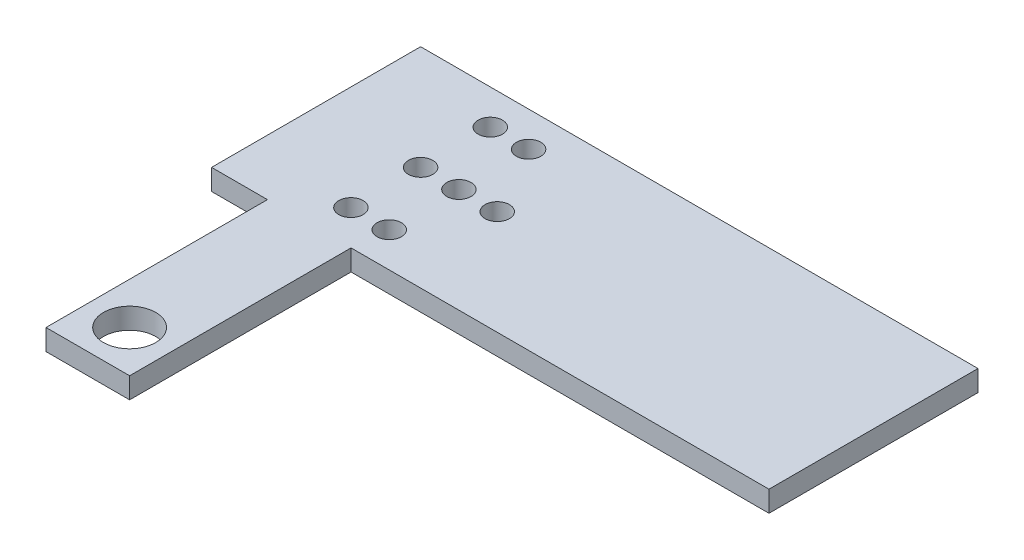
ISO-10303-21;
HEADER;
FILE_DESCRIPTION(('STEP AP214'),'2;1');
FILE_NAME('part.step','',(''),(''),'','','');
FILE_SCHEMA(('AUTOMOTIVE_DESIGN { 1 0 10303 214 1 1 1 1 }'));
ENDSEC;
DATA;
#1=APPLICATION_CONTEXT('core data for automotive mechanical design processes');
#2=APPLICATION_PROTOCOL_DEFINITION('international standard','automotive_design',2000,#1);
#3=PRODUCT_CONTEXT('',#1,'mechanical');
#4=PRODUCT('Part','Part','',(#3));
#5=PRODUCT_RELATED_PRODUCT_CATEGORY('part','',(#4));
#6=PRODUCT_DEFINITION_FORMATION('','',#4);
#7=PRODUCT_DEFINITION_CONTEXT('part definition',#1,'design');
#8=PRODUCT_DEFINITION('design','',#6,#7);
#9=PRODUCT_DEFINITION_SHAPE('','',#8);
#10=(LENGTH_UNIT() NAMED_UNIT(*) SI_UNIT(.MILLI.,.METRE.));
#11=(NAMED_UNIT(*) PLANE_ANGLE_UNIT() SI_UNIT($,.RADIAN.));
#12=(NAMED_UNIT(*) SI_UNIT($,.STERADIAN.) SOLID_ANGLE_UNIT());
#13=UNCERTAINTY_MEASURE_WITH_UNIT(LENGTH_MEASURE(1.E-05),#10,'distance_accuracy_value','');
#14=(GEOMETRIC_REPRESENTATION_CONTEXT(3) GLOBAL_UNCERTAINTY_ASSIGNED_CONTEXT((#13)) GLOBAL_UNIT_ASSIGNED_CONTEXT((#10,
#11,#12)) REPRESENTATION_CONTEXT('',''));
#15=CARTESIAN_POINT('',(0.,0.,0.));
#16=DIRECTION('',(0.,0.,1.));
#17=DIRECTION('',(1.,0.,0.));
#18=AXIS2_PLACEMENT_3D('',#15,#16,#17);
#19=CARTESIAN_POINT('',(-40.,3.,15.));
#20=DIRECTION('',(0.,0.,-1.));
#21=DIRECTION('',(-1.,0.,0.));
#22=AXIS2_PLACEMENT_3D('',#19,#20,#21);
#23=PLANE('',#22);
#24=DIRECTION('',(0.,-1.,0.));
#25=VECTOR('',#24,1.);
#26=CARTESIAN_POINT('',(-31.9821782216686,3.,15.));
#27=LINE('',#26,#25);
#28=CARTESIAN_POINT('',(-31.9821782216686,3.,15.));
#29=VERTEX_POINT('',#28);
#30=CARTESIAN_POINT('',(-31.9821782216686,0.,15.));
#31=VERTEX_POINT('',#30);
#32=EDGE_CURVE('E119',#29,#31,#27,.T.);
#33=ORIENTED_EDGE('',*,*,#32,.F.);
#34=DIRECTION('',(1.,0.,0.));
#35=VECTOR('',#34,1.);
#36=CARTESIAN_POINT('',(-40.,3.,15.));
#37=LINE('',#36,#35);
#38=CARTESIAN_POINT('',(-40.,3.,15.));
#39=VERTEX_POINT('',#38);
#40=EDGE_CURVE('E124',#39,#29,#37,.T.);
#41=ORIENTED_EDGE('',*,*,#40,.F.);
#42=DIRECTION('',(0.,-1.,0.));
#43=VECTOR('',#42,1.);
#44=CARTESIAN_POINT('',(-40.,3.,15.));
#45=LINE('',#44,#43);
#46=CARTESIAN_POINT('',(-40.,0.,15.));
#47=VERTEX_POINT('',#46);
#48=EDGE_CURVE('E144',#39,#47,#45,.T.);
#49=ORIENTED_EDGE('',*,*,#48,.T.);
#50=DIRECTION('',(1.,0.,0.));
#51=VECTOR('',#50,1.);
#52=CARTESIAN_POINT('',(-40.,0.,15.));
#53=LINE('',#52,#51);
#54=EDGE_CURVE('E139',#47,#31,#53,.T.);
#55=ORIENTED_EDGE('',*,*,#54,.T.);
#56=EDGE_LOOP('',(#33,#41,#49,#55));
#57=FACE_BOUND('',#56,.T.);
#58=ADVANCED_FACE('F33',(#57),#23,.F.);
#59=CARTESIAN_POINT('',(-14.,0.,0.));
#60=DIRECTION('',(0.,1.,0.));
#61=DIRECTION('',(0.,0.,1.));
#62=AXIS2_PLACEMENT_3D('',#59,#60,#61);
#63=CYLINDRICAL_SURFACE('',#62,1.75);
#64=CARTESIAN_POINT('',(-14.,0.,0.));
#65=DIRECTION('',(0.,1.,0.));
#66=DIRECTION('',(0.,0.,1.));
#67=AXIS2_PLACEMENT_3D('',#64,#65,#66);
#68=CIRCLE('',#67,1.75);
#69=CARTESIAN_POINT('',(-14.,0.,1.75));
#70=VERTEX_POINT('',#69);
#71=EDGE_CURVE('E41',#70,#70,#68,.T.);
#72=ORIENTED_EDGE('',*,*,#71,.F.);
#73=EDGE_LOOP('',(#72));
#74=FACE_BOUND('',#73,.T.);
#75=CARTESIAN_POINT('',(-14.,3.,0.));
#76=DIRECTION('',(0.,1.,0.));
#77=DIRECTION('',(0.,0.,1.));
#78=AXIS2_PLACEMENT_3D('',#75,#76,#77);
#79=CIRCLE('',#78,1.75);
#80=CARTESIAN_POINT('',(-14.,3.,1.75));
#81=VERTEX_POINT('',#80);
#82=EDGE_CURVE('E11',#81,#81,#79,.T.);
#83=ORIENTED_EDGE('',*,*,#82,.T.);
#84=EDGE_LOOP('',(#83));
#85=FACE_BOUND('',#84,.T.);
#86=ADVANCED_FACE('F35',(#74,#85),#63,.F.);
#87=CARTESIAN_POINT('',(40.,3.,15.));
#88=DIRECTION('',(-1.,0.,0.));
#89=DIRECTION('',(0.,0.,1.));
#90=AXIS2_PLACEMENT_3D('',#87,#88,#89);
#91=PLANE('',#90);
#92=DIRECTION('',(0.,0.,-1.));
#93=VECTOR('',#92,1.);
#94=CARTESIAN_POINT('',(40.,0.,15.));
#95=LINE('',#94,#93);
#96=CARTESIAN_POINT('',(40.,0.,15.));
#97=VERTEX_POINT('',#96);
#98=CARTESIAN_POINT('',(40.,0.,-15.));
#99=VERTEX_POINT('',#98);
#100=EDGE_CURVE('E131',#97,#99,#95,.T.);
#101=ORIENTED_EDGE('',*,*,#100,.T.);
#102=DIRECTION('',(0.,-1.,0.));
#103=VECTOR('',#102,1.);
#104=CARTESIAN_POINT('',(40.,3.,-15.));
#105=LINE('',#104,#103);
#106=CARTESIAN_POINT('',(40.,3.,-15.));
#107=VERTEX_POINT('',#106);
#108=EDGE_CURVE('E150',#107,#99,#105,.T.);
#109=ORIENTED_EDGE('',*,*,#108,.F.);
#110=DIRECTION('',(0.,0.,-1.));
#111=VECTOR('',#110,1.);
#112=CARTESIAN_POINT('',(40.,3.,15.));
#113=LINE('',#112,#111);
#114=CARTESIAN_POINT('',(40.,3.,15.));
#115=VERTEX_POINT('',#114);
#116=EDGE_CURVE('E142',#115,#107,#113,.T.);
#117=ORIENTED_EDGE('',*,*,#116,.F.);
#118=DIRECTION('',(0.,-1.,0.));
#119=VECTOR('',#118,1.);
#120=CARTESIAN_POINT('',(40.,3.,15.));
#121=LINE('',#120,#119);
#122=EDGE_CURVE('E122',#115,#97,#121,.T.);
#123=ORIENTED_EDGE('',*,*,#122,.T.);
#124=EDGE_LOOP('',(#101,#109,#117,#123));
#125=FACE_BOUND('',#124,.T.);
#126=ADVANCED_FACE('F159',(#125),#91,.F.);
#127=CARTESIAN_POINT('',(-40.,3.,-15.));
#128=DIRECTION('',(0.,0.,1.));
#129=DIRECTION('',(1.,0.,0.));
#130=AXIS2_PLACEMENT_3D('',#127,#128,#129);
#131=PLANE('',#130);
#132=DIRECTION('',(-1.,0.,0.));
#133=VECTOR('',#132,1.);
#134=CARTESIAN_POINT('',(-40.,0.,-15.));
#135=LINE('',#134,#133);
#136=CARTESIAN_POINT('',(-40.,0.,-15.));
#137=VERTEX_POINT('',#136);
#138=EDGE_CURVE('E134',#99,#137,#135,.T.);
#139=ORIENTED_EDGE('',*,*,#138,.T.);
#140=DIRECTION('',(0.,-1.,0.));
#141=VECTOR('',#140,1.);
#142=CARTESIAN_POINT('',(-40.,3.,-15.));
#143=LINE('',#142,#141);
#144=CARTESIAN_POINT('',(-40.,3.,-15.));
#145=VERTEX_POINT('',#144);
#146=EDGE_CURVE('E147',#145,#137,#143,.T.);
#147=ORIENTED_EDGE('',*,*,#146,.F.);
#148=DIRECTION('',(-1.,0.,0.));
#149=VECTOR('',#148,1.);
#150=CARTESIAN_POINT('',(-40.,3.,-15.));
#151=LINE('',#150,#149);
#152=EDGE_CURVE('E86',#107,#145,#151,.T.);
#153=ORIENTED_EDGE('',*,*,#152,.F.);
#154=ORIENTED_EDGE('',*,*,#108,.T.);
#155=EDGE_LOOP('',(#139,#147,#153,#154));
#156=FACE_BOUND('',#155,.T.);
#157=ADVANCED_FACE('F223',(#156),#131,.F.);
#158=CARTESIAN_POINT('',(-40.,3.,15.));
#159=DIRECTION('',(1.,0.,0.));
#160=DIRECTION('',(0.,0.,-1.));
#161=AXIS2_PLACEMENT_3D('',#158,#159,#160);
#162=PLANE('',#161);
#163=DIRECTION('',(0.,0.,1.));
#164=VECTOR('',#163,1.);
#165=CARTESIAN_POINT('',(-40.,0.,15.));
#166=LINE('',#165,#164);
#167=EDGE_CURVE('E137',#137,#47,#166,.T.);
#168=ORIENTED_EDGE('',*,*,#167,.T.);
#169=ORIENTED_EDGE('',*,*,#48,.F.);
#170=DIRECTION('',(0.,0.,1.));
#171=VECTOR('',#170,1.);
#172=CARTESIAN_POINT('',(-40.,3.,15.));
#173=LINE('',#172,#171);
#174=EDGE_CURVE('E125',#145,#39,#173,.T.);
#175=ORIENTED_EDGE('',*,*,#174,.F.);
#176=ORIENTED_EDGE('',*,*,#146,.T.);
#177=EDGE_LOOP('',(#168,#169,#175,#176));
#178=FACE_BOUND('',#177,.T.);
#179=ADVANCED_FACE('F226',(#178),#162,.F.);
#180=CARTESIAN_POINT('',(-19.9821782216686,3.,15.));
#181=VERTEX_POINT('',#180);
#182=EDGE_CURVE('E57',#181,#115,#37,.T.);
#183=ORIENTED_EDGE('',*,*,#182,.F.);
#184=DIRECTION('',(0.,-1.,0.));
#185=VECTOR('',#184,1.);
#186=CARTESIAN_POINT('',(-19.9821782216686,3.,15.));
#187=LINE('',#186,#185);
#188=CARTESIAN_POINT('',(-19.9821782216686,0.,15.));
#189=VERTEX_POINT('',#188);
#190=EDGE_CURVE('E116',#181,#189,#187,.T.);
#191=ORIENTED_EDGE('',*,*,#190,.T.);
#192=EDGE_CURVE('E78',#189,#97,#53,.T.);
#193=ORIENTED_EDGE('',*,*,#192,.T.);
#194=ORIENTED_EDGE('',*,*,#122,.F.);
#195=EDGE_LOOP('',(#183,#191,#193,#194));
#196=FACE_BOUND('',#195,.T.);
#197=ADVANCED_FACE('F121',(#196),#23,.F.);
#198=CARTESIAN_POINT('',(0.,3.,0.));
#199=DIRECTION('',(0.,-1.,0.));
#200=DIRECTION('',(0.,0.,-1.));
#201=AXIS2_PLACEMENT_3D('',#198,#199,#200);
#202=PLANE('',#201);
#203=CARTESIAN_POINT('',(-25.,3.,-10.));
#204=DIRECTION('',(0.,-1.,0.));
#205=DIRECTION('',(0.,0.,-1.));
#206=AXIS2_PLACEMENT_3D('',#203,#204,#205);
#207=CIRCLE('',#206,1.75);
#208=CARTESIAN_POINT('',(-25.,3.,-11.75));
#209=VERTEX_POINT('',#208);
#210=EDGE_CURVE('E190',#209,#209,#207,.T.);
#211=ORIENTED_EDGE('',*,*,#210,.T.);
#212=EDGE_LOOP('',(#211));
#213=FACE_BOUND('',#212,.T.);
#214=CARTESIAN_POINT('',(-19.5,3.,-10.));
#215=DIRECTION('',(0.,-1.,0.));
#216=DIRECTION('',(0.,0.,-1.));
#217=AXIS2_PLACEMENT_3D('',#214,#215,#216);
#218=CIRCLE('',#217,1.75);
#219=CARTESIAN_POINT('',(-19.5,3.,-11.75));
#220=VERTEX_POINT('',#219);
#221=EDGE_CURVE('E118',#220,#220,#218,.T.);
#222=ORIENTED_EDGE('',*,*,#221,.T.);
#223=EDGE_LOOP('',(#222));
#224=FACE_BOUND('',#223,.T.);
#225=CARTESIAN_POINT('',(-25.,3.,10.));
#226=DIRECTION('',(0.,1.,0.));
#227=DIRECTION('',(0.,0.,1.));
#228=AXIS2_PLACEMENT_3D('',#225,#226,#227);
#229=CIRCLE('',#228,1.75);
#230=CARTESIAN_POINT('',(-25.,3.,11.75));
#231=VERTEX_POINT('',#230);
#232=EDGE_CURVE('E202',#231,#231,#229,.T.);
#233=ORIENTED_EDGE('',*,*,#232,.F.);
#234=EDGE_LOOP('',(#233));
#235=FACE_BOUND('',#234,.T.);
#236=CARTESIAN_POINT('',(-19.5,3.,10.));
#237=DIRECTION('',(0.,1.,0.));
#238=DIRECTION('',(0.,0.,1.));
#239=AXIS2_PLACEMENT_3D('',#236,#237,#238);
#240=CIRCLE('',#239,1.75);
#241=CARTESIAN_POINT('',(-19.5,3.,11.75));
#242=VERTEX_POINT('',#241);
#243=EDGE_CURVE('E189',#242,#242,#240,.T.);
#244=ORIENTED_EDGE('',*,*,#243,.F.);
#245=EDGE_LOOP('',(#244));
#246=FACE_BOUND('',#245,.T.);
#247=CARTESIAN_POINT('',(-19.5,3.,0.));
#248=DIRECTION('',(0.,1.,0.));
#249=DIRECTION('',(0.,0.,1.));
#250=AXIS2_PLACEMENT_3D('',#247,#248,#249);
#251=CIRCLE('',#250,1.75);
#252=CARTESIAN_POINT('',(-19.5,3.,1.75));
#253=VERTEX_POINT('',#252);
#254=EDGE_CURVE('E212',#253,#253,#251,.T.);
#255=ORIENTED_EDGE('',*,*,#254,.F.);
#256=EDGE_LOOP('',(#255));
#257=FACE_BOUND('',#256,.T.);
#258=CARTESIAN_POINT('',(-25.,3.,0.));
#259=DIRECTION('',(0.,1.,0.));
#260=DIRECTION('',(0.,0.,1.));
#261=AXIS2_PLACEMENT_3D('',#258,#259,#260);
#262=CIRCLE('',#261,1.75);
#263=CARTESIAN_POINT('',(-25.,3.,1.75));
#264=VERTEX_POINT('',#263);
#265=EDGE_CURVE('E215',#264,#264,#262,.T.);
#266=ORIENTED_EDGE('',*,*,#265,.F.);
#267=EDGE_LOOP('',(#266));
#268=FACE_BOUND('',#267,.T.);
#269=ORIENTED_EDGE('',*,*,#116,.T.);
#270=ORIENTED_EDGE('',*,*,#152,.T.);
#271=ORIENTED_EDGE('',*,*,#174,.T.);
#272=ORIENTED_EDGE('',*,*,#40,.T.);
#273=DIRECTION('',(0.,0.,1.));
#274=VECTOR('',#273,1.);
#275=CARTESIAN_POINT('',(-31.9821782216686,3.,15.));
#276=LINE('',#275,#274);
#277=CARTESIAN_POINT('',(-31.9821782216686,3.,46.7838504166493));
#278=VERTEX_POINT('',#277);
#279=EDGE_CURVE('E113',#29,#278,#276,.T.);
#280=ORIENTED_EDGE('',*,*,#279,.T.);
#281=DIRECTION('',(1.,0.,0.));
#282=VECTOR('',#281,1.);
#283=CARTESIAN_POINT('',(-31.9821782216686,3.,46.7838504166493));
#284=LINE('',#283,#282);
#285=CARTESIAN_POINT('',(-19.9821782216686,3.,46.7838504166493));
#286=VERTEX_POINT('',#285);
#287=EDGE_CURVE('E111',#278,#286,#284,.T.);
#288=ORIENTED_EDGE('',*,*,#287,.T.);
#289=DIRECTION('',(0.,0.,-1.));
#290=VECTOR('',#289,1.);
#291=CARTESIAN_POINT('',(-19.9821782216686,3.,15.));
#292=LINE('',#291,#290);
#293=EDGE_CURVE('E107',#286,#181,#292,.T.);
#294=ORIENTED_EDGE('',*,*,#293,.T.);
#295=ORIENTED_EDGE('',*,*,#182,.T.);
#296=EDGE_LOOP('',(#269,#270,#271,#272,#280,#288,#294,#295));
#297=FACE_BOUND('',#296,.T.);
#298=ORIENTED_EDGE('',*,*,#82,.F.);
#299=EDGE_LOOP('',(#298));
#300=FACE_BOUND('',#299,.T.);
#301=CARTESIAN_POINT('',(-25.9821782216686,3.,40.7838504166493));
#302=DIRECTION('',(0.,1.,0.));
#303=DIRECTION('',(0.,0.,1.));
#304=AXIS2_PLACEMENT_3D('',#301,#302,#303);
#305=CIRCLE('',#304,3.75000000000001);
#306=CARTESIAN_POINT('',(-25.9821782216686,3.,44.5338504166493));
#307=VERTEX_POINT('',#306);
#308=EDGE_CURVE('E167',#307,#307,#305,.T.);
#309=ORIENTED_EDGE('',*,*,#308,.F.);
#310=EDGE_LOOP('',(#309));
#311=FACE_BOUND('',#310,.T.);
#312=ADVANCED_FACE('F108',(#213,#224,#235,#246,#257,#268,#297,#300,#311),#202,.F.);
#313=CARTESIAN_POINT('',(0.,0.,0.));
#314=DIRECTION('',(0.,-1.,0.));
#315=DIRECTION('',(0.,0.,-1.));
#316=AXIS2_PLACEMENT_3D('',#313,#314,#315);
#317=PLANE('',#316);
#318=CARTESIAN_POINT('',(-25.,0.,-10.));
#319=DIRECTION('',(0.,-1.,0.));
#320=DIRECTION('',(0.,0.,-1.));
#321=AXIS2_PLACEMENT_3D('',#318,#319,#320);
#322=CIRCLE('',#321,1.75);
#323=CARTESIAN_POINT('',(-25.,0.,-11.75));
#324=VERTEX_POINT('',#323);
#325=EDGE_CURVE('E186',#324,#324,#322,.T.);
#326=ORIENTED_EDGE('',*,*,#325,.F.);
#327=EDGE_LOOP('',(#326));
#328=FACE_BOUND('',#327,.T.);
#329=CARTESIAN_POINT('',(-19.5,0.,-10.));
#330=DIRECTION('',(0.,-1.,0.));
#331=DIRECTION('',(0.,0.,-1.));
#332=AXIS2_PLACEMENT_3D('',#329,#330,#331);
#333=CIRCLE('',#332,1.75);
#334=CARTESIAN_POINT('',(-19.5,0.,-11.75));
#335=VERTEX_POINT('',#334);
#336=EDGE_CURVE('E193',#335,#335,#333,.T.);
#337=ORIENTED_EDGE('',*,*,#336,.F.);
#338=EDGE_LOOP('',(#337));
#339=FACE_BOUND('',#338,.T.);
#340=CARTESIAN_POINT('',(-25.,0.,10.));
#341=DIRECTION('',(0.,1.,0.));
#342=DIRECTION('',(0.,0.,1.));
#343=AXIS2_PLACEMENT_3D('',#340,#341,#342);
#344=CIRCLE('',#343,1.75);
#345=CARTESIAN_POINT('',(-25.,0.,11.75));
#346=VERTEX_POINT('',#345);
#347=EDGE_CURVE('E198',#346,#346,#344,.T.);
#348=ORIENTED_EDGE('',*,*,#347,.T.);
#349=EDGE_LOOP('',(#348));
#350=FACE_BOUND('',#349,.T.);
#351=CARTESIAN_POINT('',(-19.5,0.,10.));
#352=DIRECTION('',(0.,1.,0.));
#353=DIRECTION('',(0.,0.,1.));
#354=AXIS2_PLACEMENT_3D('',#351,#352,#353);
#355=CIRCLE('',#354,1.75);
#356=CARTESIAN_POINT('',(-19.5,0.,11.75));
#357=VERTEX_POINT('',#356);
#358=EDGE_CURVE('E205',#357,#357,#355,.T.);
#359=ORIENTED_EDGE('',*,*,#358,.T.);
#360=EDGE_LOOP('',(#359));
#361=FACE_BOUND('',#360,.T.);
#362=CARTESIAN_POINT('',(-19.5,0.,0.));
#363=DIRECTION('',(0.,1.,0.));
#364=DIRECTION('',(0.,0.,1.));
#365=AXIS2_PLACEMENT_3D('',#362,#363,#364);
#366=CIRCLE('',#365,1.75);
#367=CARTESIAN_POINT('',(-19.5,0.,1.75));
#368=VERTEX_POINT('',#367);
#369=EDGE_CURVE('E201',#368,#368,#366,.T.);
#370=ORIENTED_EDGE('',*,*,#369,.T.);
#371=EDGE_LOOP('',(#370));
#372=FACE_BOUND('',#371,.T.);
#373=CARTESIAN_POINT('',(-25.,0.,0.));
#374=DIRECTION('',(0.,1.,0.));
#375=DIRECTION('',(0.,0.,1.));
#376=AXIS2_PLACEMENT_3D('',#373,#374,#375);
#377=CIRCLE('',#376,1.75);
#378=CARTESIAN_POINT('',(-25.,0.,1.75));
#379=VERTEX_POINT('',#378);
#380=EDGE_CURVE('E135',#379,#379,#377,.T.);
#381=ORIENTED_EDGE('',*,*,#380,.T.);
#382=EDGE_LOOP('',(#381));
#383=FACE_BOUND('',#382,.T.);
#384=ORIENTED_EDGE('',*,*,#100,.F.);
#385=ORIENTED_EDGE('',*,*,#192,.F.);
#386=DIRECTION('',(0.,0.,-1.));
#387=VECTOR('',#386,1.);
#388=CARTESIAN_POINT('',(-19.9821782216686,0.,15.));
#389=LINE('',#388,#387);
#390=CARTESIAN_POINT('',(-19.9821782216686,0.,46.7838504166493));
#391=VERTEX_POINT('',#390);
#392=EDGE_CURVE('E48',#391,#189,#389,.T.);
#393=ORIENTED_EDGE('',*,*,#392,.F.);
#394=DIRECTION('',(1.,0.,0.));
#395=VECTOR('',#394,1.);
#396=CARTESIAN_POINT('',(-31.9821782216686,0.,46.7838504166493));
#397=LINE('',#396,#395);
#398=CARTESIAN_POINT('',(-31.9821782216686,0.,46.7838504166493));
#399=VERTEX_POINT('',#398);
#400=EDGE_CURVE('E114',#399,#391,#397,.T.);
#401=ORIENTED_EDGE('',*,*,#400,.F.);
#402=DIRECTION('',(0.,0.,1.));
#403=VECTOR('',#402,1.);
#404=CARTESIAN_POINT('',(-31.9821782216686,0.,15.));
#405=LINE('',#404,#403);
#406=EDGE_CURVE('E171',#31,#399,#405,.T.);
#407=ORIENTED_EDGE('',*,*,#406,.F.);
#408=ORIENTED_EDGE('',*,*,#54,.F.);
#409=ORIENTED_EDGE('',*,*,#167,.F.);
#410=ORIENTED_EDGE('',*,*,#138,.F.);
#411=EDGE_LOOP('',(#384,#385,#393,#401,#407,#408,#409,#410));
#412=FACE_BOUND('',#411,.T.);
#413=ORIENTED_EDGE('',*,*,#71,.T.);
#414=EDGE_LOOP('',(#413));
#415=FACE_BOUND('',#414,.T.);
#416=CARTESIAN_POINT('',(-25.9821782216686,0.,40.7838504166493));
#417=DIRECTION('',(0.,1.,0.));
#418=DIRECTION('',(0.,0.,1.));
#419=AXIS2_PLACEMENT_3D('',#416,#417,#418);
#420=CIRCLE('',#419,3.75000000000001);
#421=CARTESIAN_POINT('',(-25.9821782216686,0.,44.5338504166493));
#422=VERTEX_POINT('',#421);
#423=EDGE_CURVE('E169',#422,#422,#420,.T.);
#424=ORIENTED_EDGE('',*,*,#423,.T.);
#425=EDGE_LOOP('',(#424));
#426=FACE_BOUND('',#425,.T.);
#427=ADVANCED_FACE('F154',(#328,#339,#350,#361,#372,#383,#412,#415,#426),#317,.T.);
#428=CARTESIAN_POINT('',(-25.,0.,0.));
#429=DIRECTION('',(0.,1.,0.));
#430=DIRECTION('',(0.,0.,1.));
#431=AXIS2_PLACEMENT_3D('',#428,#429,#430);
#432=CYLINDRICAL_SURFACE('',#431,1.75);
#433=ORIENTED_EDGE('',*,*,#380,.F.);
#434=EDGE_LOOP('',(#433));
#435=FACE_BOUND('',#434,.T.);
#436=ORIENTED_EDGE('',*,*,#265,.T.);
#437=EDGE_LOOP('',(#436));
#438=FACE_BOUND('',#437,.T.);
#439=ADVANCED_FACE('F291',(#435,#438),#432,.F.);
#440=CARTESIAN_POINT('',(-19.5,0.,0.));
#441=DIRECTION('',(0.,1.,0.));
#442=DIRECTION('',(0.,0.,1.));
#443=AXIS2_PLACEMENT_3D('',#440,#441,#442);
#444=CYLINDRICAL_SURFACE('',#443,1.75);
#445=ORIENTED_EDGE('',*,*,#369,.F.);
#446=EDGE_LOOP('',(#445));
#447=FACE_BOUND('',#446,.T.);
#448=ORIENTED_EDGE('',*,*,#254,.T.);
#449=EDGE_LOOP('',(#448));
#450=FACE_BOUND('',#449,.T.);
#451=ADVANCED_FACE('F301',(#447,#450),#444,.F.);
#452=CARTESIAN_POINT('',(-19.5,0.,10.));
#453=DIRECTION('',(0.,1.,0.));
#454=DIRECTION('',(0.,0.,1.));
#455=AXIS2_PLACEMENT_3D('',#452,#453,#454);
#456=CYLINDRICAL_SURFACE('',#455,1.75);
#457=ORIENTED_EDGE('',*,*,#358,.F.);
#458=EDGE_LOOP('',(#457));
#459=FACE_BOUND('',#458,.T.);
#460=ORIENTED_EDGE('',*,*,#243,.T.);
#461=EDGE_LOOP('',(#460));
#462=FACE_BOUND('',#461,.T.);
#463=ADVANCED_FACE('F315',(#459,#462),#456,.F.);
#464=CARTESIAN_POINT('',(-25.,0.,10.));
#465=DIRECTION('',(0.,1.,0.));
#466=DIRECTION('',(0.,0.,1.));
#467=AXIS2_PLACEMENT_3D('',#464,#465,#466);
#468=CYLINDRICAL_SURFACE('',#467,1.75);
#469=ORIENTED_EDGE('',*,*,#347,.F.);
#470=EDGE_LOOP('',(#469));
#471=FACE_BOUND('',#470,.T.);
#472=ORIENTED_EDGE('',*,*,#232,.T.);
#473=EDGE_LOOP('',(#472));
#474=FACE_BOUND('',#473,.T.);
#475=ADVANCED_FACE('F324',(#471,#474),#468,.F.);
#476=CARTESIAN_POINT('',(-19.5,0.,-10.));
#477=DIRECTION('',(0.,1.,0.));
#478=DIRECTION('',(0.,0.,1.));
#479=AXIS2_PLACEMENT_3D('',#476,#477,#478);
#480=CYLINDRICAL_SURFACE('',#479,1.75);
#481=ORIENTED_EDGE('',*,*,#336,.T.);
#482=EDGE_LOOP('',(#481));
#483=FACE_BOUND('',#482,.T.);
#484=ORIENTED_EDGE('',*,*,#221,.F.);
#485=EDGE_LOOP('',(#484));
#486=FACE_BOUND('',#485,.T.);
#487=ADVANCED_FACE('F333',(#483,#486),#480,.F.);
#488=CARTESIAN_POINT('',(-25.,0.,-10.));
#489=DIRECTION('',(0.,1.,0.));
#490=DIRECTION('',(0.,0.,1.));
#491=AXIS2_PLACEMENT_3D('',#488,#489,#490);
#492=CYLINDRICAL_SURFACE('',#491,1.75);
#493=ORIENTED_EDGE('',*,*,#325,.T.);
#494=EDGE_LOOP('',(#493));
#495=FACE_BOUND('',#494,.T.);
#496=ORIENTED_EDGE('',*,*,#210,.F.);
#497=EDGE_LOOP('',(#496));
#498=FACE_BOUND('',#497,.T.);
#499=ADVANCED_FACE('F342',(#495,#498),#492,.F.);
#500=CARTESIAN_POINT('',(-19.9821782216686,3.,15.));
#501=DIRECTION('',(-1.,0.,0.));
#502=DIRECTION('',(0.,0.,1.));
#503=AXIS2_PLACEMENT_3D('',#500,#501,#502);
#504=PLANE('',#503);
#505=ORIENTED_EDGE('',*,*,#392,.T.);
#506=ORIENTED_EDGE('',*,*,#190,.F.);
#507=ORIENTED_EDGE('',*,*,#293,.F.);
#508=DIRECTION('',(0.,-1.,0.));
#509=VECTOR('',#508,1.);
#510=CARTESIAN_POINT('',(-19.9821782216686,3.,46.7838504166493));
#511=LINE('',#510,#509);
#512=EDGE_CURVE('E177',#286,#391,#511,.T.);
#513=ORIENTED_EDGE('',*,*,#512,.T.);
#514=EDGE_LOOP('',(#505,#506,#507,#513));
#515=FACE_BOUND('',#514,.T.);
#516=ADVANCED_FACE('F117',(#515),#504,.F.);
#517=CARTESIAN_POINT('',(-31.9821782216686,3.,15.));
#518=DIRECTION('',(1.,0.,0.));
#519=DIRECTION('',(0.,0.,-1.));
#520=AXIS2_PLACEMENT_3D('',#517,#518,#519);
#521=PLANE('',#520);
#522=ORIENTED_EDGE('',*,*,#406,.T.);
#523=DIRECTION('',(0.,-1.,0.));
#524=VECTOR('',#523,1.);
#525=CARTESIAN_POINT('',(-31.9821782216686,3.,46.7838504166493));
#526=LINE('',#525,#524);
#527=EDGE_CURVE('E182',#278,#399,#526,.T.);
#528=ORIENTED_EDGE('',*,*,#527,.F.);
#529=ORIENTED_EDGE('',*,*,#279,.F.);
#530=ORIENTED_EDGE('',*,*,#32,.T.);
#531=EDGE_LOOP('',(#522,#528,#529,#530));
#532=FACE_BOUND('',#531,.T.);
#533=ADVANCED_FACE('F233',(#532),#521,.F.);
#534=CARTESIAN_POINT('',(-31.9821782216686,3.,46.7838504166493));
#535=DIRECTION('',(0.,0.,-1.));
#536=DIRECTION('',(-1.,0.,0.));
#537=AXIS2_PLACEMENT_3D('',#534,#535,#536);
#538=PLANE('',#537);
#539=ORIENTED_EDGE('',*,*,#400,.T.);
#540=ORIENTED_EDGE('',*,*,#512,.F.);
#541=ORIENTED_EDGE('',*,*,#287,.F.);
#542=ORIENTED_EDGE('',*,*,#527,.T.);
#543=EDGE_LOOP('',(#539,#540,#541,#542));
#544=FACE_BOUND('',#543,.T.);
#545=ADVANCED_FACE('F237',(#544),#538,.F.);
#546=CARTESIAN_POINT('',(-25.9821782216686,3.,40.7838504166493));
#547=DIRECTION('',(0.,-1.,0.));
#548=DIRECTION('',(0.,0.,-1.));
#549=AXIS2_PLACEMENT_3D('',#546,#547,#548);
#550=CYLINDRICAL_SURFACE('',#549,3.75000000000001);
#551=ORIENTED_EDGE('',*,*,#308,.T.);
#552=EDGE_LOOP('',(#551));
#553=FACE_BOUND('',#552,.T.);
#554=ORIENTED_EDGE('',*,*,#423,.F.);
#555=EDGE_LOOP('',(#554));
#556=FACE_BOUND('',#555,.T.);
#557=ADVANCED_FACE('F373',(#553,#556),#550,.F.);
#558=CLOSED_SHELL('',(#58,#86,#126,#157,#179,#197,#312,#427,#439,#451,#463,#475,#487,#499,#516,
#533,#545,#557));
#559=MANIFOLD_SOLID_BREP('B2',#558);
#560=ADVANCED_BREP_SHAPE_REPRESENTATION('',(#18,#559),#14);
#561=SHAPE_DEFINITION_REPRESENTATION(#9,#560);
ENDSEC;
END-ISO-10303-21;
